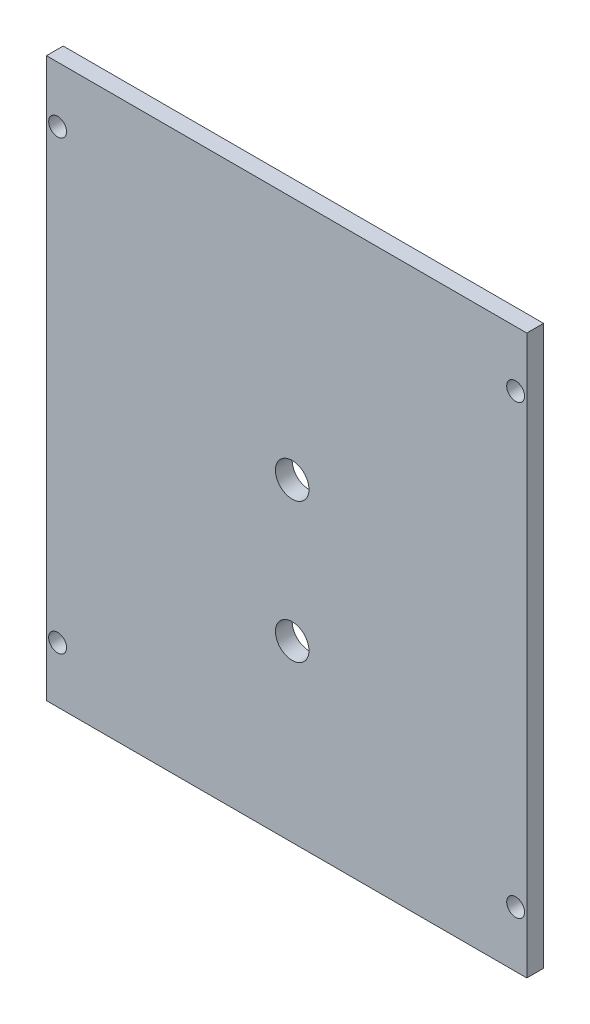
ISO-10303-21;
HEADER;
FILE_DESCRIPTION(('STEP AP214'),'2;1');
FILE_NAME('part.step','',(''),(''),'','','');
FILE_SCHEMA(('AUTOMOTIVE_DESIGN { 1 0 10303 214 1 1 1 1 }'));
ENDSEC;
DATA;
#1=APPLICATION_CONTEXT('core data for automotive mechanical design processes');
#2=APPLICATION_PROTOCOL_DEFINITION('international standard','automotive_design',2000,#1);
#3=PRODUCT_CONTEXT('',#1,'mechanical');
#4=PRODUCT('Part','Part','',(#3));
#5=PRODUCT_RELATED_PRODUCT_CATEGORY('part','',(#4));
#6=PRODUCT_DEFINITION_FORMATION('','',#4);
#7=PRODUCT_DEFINITION_CONTEXT('part definition',#1,'design');
#8=PRODUCT_DEFINITION('design','',#6,#7);
#9=PRODUCT_DEFINITION_SHAPE('','',#8);
#10=(LENGTH_UNIT() NAMED_UNIT(*) SI_UNIT(.MILLI.,.METRE.));
#11=(NAMED_UNIT(*) PLANE_ANGLE_UNIT() SI_UNIT($,.RADIAN.));
#12=(NAMED_UNIT(*) SI_UNIT($,.STERADIAN.) SOLID_ANGLE_UNIT());
#13=UNCERTAINTY_MEASURE_WITH_UNIT(LENGTH_MEASURE(1.E-05),#10,'distance_accuracy_value','');
#14=(GEOMETRIC_REPRESENTATION_CONTEXT(3) GLOBAL_UNCERTAINTY_ASSIGNED_CONTEXT((#13)) GLOBAL_UNIT_ASSIGNED_CONTEXT((#10,
#11,#12)) REPRESENTATION_CONTEXT('',''));
#15=CARTESIAN_POINT('',(0.,0.,0.));
#16=DIRECTION('',(0.,0.,1.));
#17=DIRECTION('',(1.,0.,0.));
#18=AXIS2_PLACEMENT_3D('',#15,#16,#17);
#19=CARTESIAN_POINT('',(0.,0.,3.));
#20=DIRECTION('',(0.,1.,0.));
#21=DIRECTION('',(0.,0.,1.));
#22=AXIS2_PLACEMENT_3D('',#19,#20,#21);
#23=PLANE('',#22);
#24=DIRECTION('',(1.,0.,0.));
#25=VECTOR('',#24,1.);
#26=CARTESIAN_POINT('',(0.,0.,0.));
#27=LINE('',#26,#25);
#28=CARTESIAN_POINT('',(-2.,0.,0.));
#29=VERTEX_POINT('',#28);
#30=CARTESIAN_POINT('',(84.,0.,0.));
#31=VERTEX_POINT('',#30);
#32=EDGE_CURVE('E62',#29,#31,#27,.T.);
#33=ORIENTED_EDGE('',*,*,#32,.T.);
#34=DIRECTION('',(0.,0.,-1.));
#35=VECTOR('',#34,1.);
#36=CARTESIAN_POINT('',(84.,0.,3.));
#37=LINE('',#36,#35);
#38=CARTESIAN_POINT('',(84.,0.,3.));
#39=VERTEX_POINT('',#38);
#40=EDGE_CURVE('E11',#39,#31,#37,.T.);
#41=ORIENTED_EDGE('',*,*,#40,.F.);
#42=DIRECTION('',(1.,0.,0.));
#43=VECTOR('',#42,1.);
#44=CARTESIAN_POINT('',(0.,0.,3.));
#45=LINE('',#44,#43);
#46=CARTESIAN_POINT('',(-2.,0.,3.));
#47=VERTEX_POINT('',#46);
#48=EDGE_CURVE('E89',#47,#39,#45,.T.);
#49=ORIENTED_EDGE('',*,*,#48,.F.);
#50=DIRECTION('',(0.,0.,1.));
#51=VECTOR('',#50,1.);
#52=CARTESIAN_POINT('',(-2.,0.,0.));
#53=LINE('',#52,#51);
#54=EDGE_CURVE('E88',#29,#47,#53,.T.);
#55=ORIENTED_EDGE('',*,*,#54,.F.);
#56=EDGE_LOOP('',(#33,#41,#49,#55));
#57=FACE_BOUND('',#56,.T.);
#58=ADVANCED_FACE('F35',(#57),#23,.F.);
#59=CARTESIAN_POINT('',(84.,0.,3.));
#60=DIRECTION('',(-1.,0.,0.));
#61=DIRECTION('',(0.,0.,1.));
#62=AXIS2_PLACEMENT_3D('',#59,#60,#61);
#63=PLANE('',#62);
#64=DIRECTION('',(0.,1.,0.));
#65=VECTOR('',#64,1.);
#66=CARTESIAN_POINT('',(84.,0.,0.));
#67=LINE('',#66,#65);
#68=CARTESIAN_POINT('',(84.,100.,0.));
#69=VERTEX_POINT('',#68);
#70=EDGE_CURVE('E84',#31,#69,#67,.T.);
#71=ORIENTED_EDGE('',*,*,#70,.T.);
#72=DIRECTION('',(0.,0.,-1.));
#73=VECTOR('',#72,1.);
#74=CARTESIAN_POINT('',(84.,100.,3.));
#75=LINE('',#74,#73);
#76=CARTESIAN_POINT('',(84.,100.,3.));
#77=VERTEX_POINT('',#76);
#78=EDGE_CURVE('E43',#77,#69,#75,.T.);
#79=ORIENTED_EDGE('',*,*,#78,.F.);
#80=DIRECTION('',(0.,1.,0.));
#81=VECTOR('',#80,1.);
#82=CARTESIAN_POINT('',(84.,0.,3.));
#83=LINE('',#82,#81);
#84=EDGE_CURVE('E51',#39,#77,#83,.T.);
#85=ORIENTED_EDGE('',*,*,#84,.F.);
#86=ORIENTED_EDGE('',*,*,#40,.T.);
#87=EDGE_LOOP('',(#71,#79,#85,#86));
#88=FACE_BOUND('',#87,.T.);
#89=ADVANCED_FACE('F125',(#88),#63,.F.);
#90=CARTESIAN_POINT('',(0.,100.,3.));
#91=DIRECTION('',(0.,-1.,0.));
#92=DIRECTION('',(0.,0.,-1.));
#93=AXIS2_PLACEMENT_3D('',#90,#91,#92);
#94=PLANE('',#93);
#95=DIRECTION('',(-1.,0.,0.));
#96=VECTOR('',#95,1.);
#97=CARTESIAN_POINT('',(0.,100.,0.));
#98=LINE('',#97,#96);
#99=CARTESIAN_POINT('',(-2.,100.,0.));
#100=VERTEX_POINT('',#99);
#101=EDGE_CURVE('E70',#69,#100,#98,.T.);
#102=ORIENTED_EDGE('',*,*,#101,.T.);
#103=DIRECTION('',(0.,0.,-1.));
#104=VECTOR('',#103,1.);
#105=CARTESIAN_POINT('',(-2.,100.,0.));
#106=LINE('',#105,#104);
#107=CARTESIAN_POINT('',(-2.,100.,3.));
#108=VERTEX_POINT('',#107);
#109=EDGE_CURVE('E96',#108,#100,#106,.T.);
#110=ORIENTED_EDGE('',*,*,#109,.F.);
#111=DIRECTION('',(-1.,0.,0.));
#112=VECTOR('',#111,1.);
#113=CARTESIAN_POINT('',(0.,100.,3.));
#114=LINE('',#113,#112);
#115=EDGE_CURVE('E119',#77,#108,#114,.T.);
#116=ORIENTED_EDGE('',*,*,#115,.F.);
#117=ORIENTED_EDGE('',*,*,#78,.T.);
#118=EDGE_LOOP('',(#102,#110,#116,#117));
#119=FACE_BOUND('',#118,.T.);
#120=ADVANCED_FACE('F123',(#119),#94,.F.);
#121=CARTESIAN_POINT('',(0.,0.,3.));
#122=DIRECTION('',(0.,0.,-1.));
#123=DIRECTION('',(-1.,0.,0.));
#124=AXIS2_PLACEMENT_3D('',#121,#122,#123);
#125=PLANE('',#124);
#126=CARTESIAN_POINT('',(82.,90.,3.));
#127=DIRECTION('',(0.,0.,1.));
#128=DIRECTION('',(-1.,0.,0.));
#129=AXIS2_PLACEMENT_3D('',#126,#127,#128);
#130=CIRCLE('',#129,1.6);
#131=CARTESIAN_POINT('',(80.4,90.,3.));
#132=VERTEX_POINT('',#131);
#133=EDGE_CURVE('E173',#132,#132,#130,.T.);
#134=ORIENTED_EDGE('',*,*,#133,.F.);
#135=EDGE_LOOP('',(#134));
#136=FACE_BOUND('',#135,.T.);
#137=CARTESIAN_POINT('',(0.,90.,3.));
#138=DIRECTION('',(0.,0.,1.));
#139=DIRECTION('',(1.,0.,0.));
#140=AXIS2_PLACEMENT_3D('',#137,#138,#139);
#141=CIRCLE('',#140,1.6);
#142=CARTESIAN_POINT('',(1.6,90.,3.));
#143=VERTEX_POINT('',#142);
#144=EDGE_CURVE('E178',#143,#143,#141,.T.);
#145=ORIENTED_EDGE('',*,*,#144,.F.);
#146=EDGE_LOOP('',(#145));
#147=FACE_BOUND('',#146,.T.);
#148=CARTESIAN_POINT('',(0.,10.,3.));
#149=DIRECTION('',(0.,0.,1.));
#150=DIRECTION('',(-1.,0.,0.));
#151=AXIS2_PLACEMENT_3D('',#148,#149,#150);
#152=CIRCLE('',#151,1.6);
#153=CARTESIAN_POINT('',(-1.6,10.,3.));
#154=VERTEX_POINT('',#153);
#155=EDGE_CURVE('E186',#154,#154,#152,.T.);
#156=ORIENTED_EDGE('',*,*,#155,.F.);
#157=EDGE_LOOP('',(#156));
#158=FACE_BOUND('',#157,.T.);
#159=CARTESIAN_POINT('',(82.,10.,3.));
#160=DIRECTION('',(0.,0.,1.));
#161=DIRECTION('',(1.,0.,0.));
#162=AXIS2_PLACEMENT_3D('',#159,#160,#161);
#163=CIRCLE('',#162,1.6);
#164=CARTESIAN_POINT('',(83.6,10.,3.));
#165=VERTEX_POINT('',#164);
#166=EDGE_CURVE('E100',#165,#165,#163,.T.);
#167=ORIENTED_EDGE('',*,*,#166,.F.);
#168=EDGE_LOOP('',(#167));
#169=FACE_BOUND('',#168,.T.);
#170=CARTESIAN_POINT('',(42.,56.24,3.));
#171=DIRECTION('',(0.,0.,1.));
#172=DIRECTION('',(1.,0.,0.));
#173=AXIS2_PLACEMENT_3D('',#170,#171,#172);
#174=CIRCLE('',#173,3.);
#175=CARTESIAN_POINT('',(45.,56.24,3.));
#176=VERTEX_POINT('',#175);
#177=EDGE_CURVE('E106',#176,#176,#174,.T.);
#178=ORIENTED_EDGE('',*,*,#177,.F.);
#179=EDGE_LOOP('',(#178));
#180=FACE_BOUND('',#179,.T.);
#181=CARTESIAN_POINT('',(42.,31.24,3.));
#182=DIRECTION('',(0.,0.,1.));
#183=DIRECTION('',(1.,0.,0.));
#184=AXIS2_PLACEMENT_3D('',#181,#182,#183);
#185=CIRCLE('',#184,3.);
#186=CARTESIAN_POINT('',(45.,31.24,3.));
#187=VERTEX_POINT('',#186);
#188=EDGE_CURVE('E110',#187,#187,#185,.T.);
#189=ORIENTED_EDGE('',*,*,#188,.F.);
#190=EDGE_LOOP('',(#189));
#191=FACE_BOUND('',#190,.T.);
#192=ORIENTED_EDGE('',*,*,#115,.T.);
#193=DIRECTION('',(0.,1.,0.));
#194=VECTOR('',#193,1.);
#195=CARTESIAN_POINT('',(-2.,0.,3.));
#196=LINE('',#195,#194);
#197=EDGE_CURVE('E93',#47,#108,#196,.T.);
#198=ORIENTED_EDGE('',*,*,#197,.F.);
#199=ORIENTED_EDGE('',*,*,#48,.T.);
#200=ORIENTED_EDGE('',*,*,#84,.T.);
#201=EDGE_LOOP('',(#192,#198,#199,#200));
#202=FACE_BOUND('',#201,.T.);
#203=ADVANCED_FACE('F131',(#136,#147,#158,#169,#180,#191,#202),#125,.F.);
#204=CARTESIAN_POINT('',(0.,0.,0.));
#205=DIRECTION('',(0.,0.,-1.));
#206=DIRECTION('',(-1.,0.,0.));
#207=AXIS2_PLACEMENT_3D('',#204,#205,#206);
#208=PLANE('',#207);
#209=CARTESIAN_POINT('',(82.,90.,0.));
#210=DIRECTION('',(0.,0.,1.));
#211=DIRECTION('',(-1.,0.,0.));
#212=AXIS2_PLACEMENT_3D('',#209,#210,#211);
#213=CIRCLE('',#212,1.6);
#214=CARTESIAN_POINT('',(80.4,90.,0.));
#215=VERTEX_POINT('',#214);
#216=EDGE_CURVE('E170',#215,#215,#213,.T.);
#217=ORIENTED_EDGE('',*,*,#216,.T.);
#218=EDGE_LOOP('',(#217));
#219=FACE_BOUND('',#218,.T.);
#220=CARTESIAN_POINT('',(0.,90.,0.));
#221=DIRECTION('',(0.,0.,1.));
#222=DIRECTION('',(1.,0.,0.));
#223=AXIS2_PLACEMENT_3D('',#220,#221,#222);
#224=CIRCLE('',#223,1.6);
#225=CARTESIAN_POINT('',(1.6,90.,0.));
#226=VERTEX_POINT('',#225);
#227=EDGE_CURVE('E174',#226,#226,#224,.T.);
#228=ORIENTED_EDGE('',*,*,#227,.T.);
#229=EDGE_LOOP('',(#228));
#230=FACE_BOUND('',#229,.T.);
#231=CARTESIAN_POINT('',(0.,10.,0.));
#232=DIRECTION('',(0.,0.,1.));
#233=DIRECTION('',(-1.,0.,0.));
#234=AXIS2_PLACEMENT_3D('',#231,#232,#233);
#235=CIRCLE('',#234,1.6);
#236=CARTESIAN_POINT('',(-1.6,10.,0.));
#237=VERTEX_POINT('',#236);
#238=EDGE_CURVE('E183',#237,#237,#235,.T.);
#239=ORIENTED_EDGE('',*,*,#238,.T.);
#240=EDGE_LOOP('',(#239));
#241=FACE_BOUND('',#240,.T.);
#242=CARTESIAN_POINT('',(82.,10.,0.));
#243=DIRECTION('',(0.,0.,1.));
#244=DIRECTION('',(1.,0.,0.));
#245=AXIS2_PLACEMENT_3D('',#242,#243,#244);
#246=CIRCLE('',#245,1.6);
#247=CARTESIAN_POINT('',(83.6,10.,0.));
#248=VERTEX_POINT('',#247);
#249=EDGE_CURVE('E97',#248,#248,#246,.T.);
#250=ORIENTED_EDGE('',*,*,#249,.T.);
#251=EDGE_LOOP('',(#250));
#252=FACE_BOUND('',#251,.T.);
#253=CARTESIAN_POINT('',(42.,56.24,0.));
#254=DIRECTION('',(0.,0.,1.));
#255=DIRECTION('',(1.,0.,0.));
#256=AXIS2_PLACEMENT_3D('',#253,#254,#255);
#257=CIRCLE('',#256,3.);
#258=CARTESIAN_POINT('',(45.,56.24,0.));
#259=VERTEX_POINT('',#258);
#260=EDGE_CURVE('E107',#259,#259,#257,.T.);
#261=ORIENTED_EDGE('',*,*,#260,.T.);
#262=EDGE_LOOP('',(#261));
#263=FACE_BOUND('',#262,.T.);
#264=CARTESIAN_POINT('',(42.,31.24,0.));
#265=DIRECTION('',(0.,0.,1.));
#266=DIRECTION('',(1.,0.,0.));
#267=AXIS2_PLACEMENT_3D('',#264,#265,#266);
#268=CIRCLE('',#267,3.);
#269=CARTESIAN_POINT('',(45.,31.24,0.));
#270=VERTEX_POINT('',#269);
#271=EDGE_CURVE('E85',#270,#270,#268,.T.);
#272=ORIENTED_EDGE('',*,*,#271,.T.);
#273=EDGE_LOOP('',(#272));
#274=FACE_BOUND('',#273,.T.);
#275=ORIENTED_EDGE('',*,*,#32,.F.);
#276=DIRECTION('',(0.,-1.,0.));
#277=VECTOR('',#276,1.);
#278=CARTESIAN_POINT('',(-2.,0.,0.));
#279=LINE('',#278,#277);
#280=EDGE_CURVE('E83',#100,#29,#279,.T.);
#281=ORIENTED_EDGE('',*,*,#280,.F.);
#282=ORIENTED_EDGE('',*,*,#101,.F.);
#283=ORIENTED_EDGE('',*,*,#70,.F.);
#284=EDGE_LOOP('',(#275,#281,#282,#283));
#285=FACE_BOUND('',#284,.T.);
#286=ADVANCED_FACE('F81',(#219,#230,#241,#252,#263,#274,#285),#208,.T.);
#287=CARTESIAN_POINT('',(42.,31.24,0.));
#288=DIRECTION('',(0.,0.,1.));
#289=DIRECTION('',(1.,0.,0.));
#290=AXIS2_PLACEMENT_3D('',#287,#288,#289);
#291=CYLINDRICAL_SURFACE('',#290,3.);
#292=ORIENTED_EDGE('',*,*,#271,.F.);
#293=EDGE_LOOP('',(#292));
#294=FACE_BOUND('',#293,.T.);
#295=ORIENTED_EDGE('',*,*,#188,.T.);
#296=EDGE_LOOP('',(#295));
#297=FACE_BOUND('',#296,.T.);
#298=ADVANCED_FACE('F137',(#294,#297),#291,.F.);
#299=CARTESIAN_POINT('',(42.,56.24,0.));
#300=DIRECTION('',(0.,0.,1.));
#301=DIRECTION('',(1.,0.,0.));
#302=AXIS2_PLACEMENT_3D('',#299,#300,#301);
#303=CYLINDRICAL_SURFACE('',#302,3.);
#304=ORIENTED_EDGE('',*,*,#260,.F.);
#305=EDGE_LOOP('',(#304));
#306=FACE_BOUND('',#305,.T.);
#307=ORIENTED_EDGE('',*,*,#177,.T.);
#308=EDGE_LOOP('',(#307));
#309=FACE_BOUND('',#308,.T.);
#310=ADVANCED_FACE('F143',(#306,#309),#303,.F.);
#311=CARTESIAN_POINT('',(-2.,0.,0.));
#312=DIRECTION('',(1.,0.,0.));
#313=DIRECTION('',(0.,0.,-1.));
#314=AXIS2_PLACEMENT_3D('',#311,#312,#313);
#315=PLANE('',#314);
#316=ORIENTED_EDGE('',*,*,#280,.T.);
#317=ORIENTED_EDGE('',*,*,#54,.T.);
#318=ORIENTED_EDGE('',*,*,#197,.T.);
#319=ORIENTED_EDGE('',*,*,#109,.T.);
#320=EDGE_LOOP('',(#316,#317,#318,#319));
#321=FACE_BOUND('',#320,.T.);
#322=ADVANCED_FACE('F95',(#321),#315,.F.);
#323=CARTESIAN_POINT('',(82.,10.,0.));
#324=DIRECTION('',(0.,0.,1.));
#325=DIRECTION('',(1.,0.,0.));
#326=AXIS2_PLACEMENT_3D('',#323,#324,#325);
#327=CYLINDRICAL_SURFACE('',#326,1.6);
#328=ORIENTED_EDGE('',*,*,#249,.F.);
#329=EDGE_LOOP('',(#328));
#330=FACE_BOUND('',#329,.T.);
#331=ORIENTED_EDGE('',*,*,#166,.T.);
#332=EDGE_LOOP('',(#331));
#333=FACE_BOUND('',#332,.T.);
#334=ADVANCED_FACE('F150',(#330,#333),#327,.F.);
#335=CARTESIAN_POINT('',(0.,10.,0.));
#336=DIRECTION('',(0.,0.,1.));
#337=DIRECTION('',(1.,0.,0.));
#338=AXIS2_PLACEMENT_3D('',#335,#336,#337);
#339=CYLINDRICAL_SURFACE('',#338,1.6);
#340=ORIENTED_EDGE('',*,*,#238,.F.);
#341=EDGE_LOOP('',(#340));
#342=FACE_BOUND('',#341,.T.);
#343=ORIENTED_EDGE('',*,*,#155,.T.);
#344=EDGE_LOOP('',(#343));
#345=FACE_BOUND('',#344,.T.);
#346=ADVANCED_FACE('F153',(#342,#345),#339,.F.);
#347=CARTESIAN_POINT('',(0.,90.,0.));
#348=DIRECTION('',(0.,0.,1.));
#349=DIRECTION('',(1.,0.,0.));
#350=AXIS2_PLACEMENT_3D('',#347,#348,#349);
#351=CYLINDRICAL_SURFACE('',#350,1.6);
#352=ORIENTED_EDGE('',*,*,#227,.F.);
#353=EDGE_LOOP('',(#352));
#354=FACE_BOUND('',#353,.T.);
#355=ORIENTED_EDGE('',*,*,#144,.T.);
#356=EDGE_LOOP('',(#355));
#357=FACE_BOUND('',#356,.T.);
#358=ADVANCED_FACE('F157',(#354,#357),#351,.F.);
#359=CARTESIAN_POINT('',(82.,90.,0.));
#360=DIRECTION('',(0.,0.,1.));
#361=DIRECTION('',(1.,0.,0.));
#362=AXIS2_PLACEMENT_3D('',#359,#360,#361);
#363=CYLINDRICAL_SURFACE('',#362,1.6);
#364=ORIENTED_EDGE('',*,*,#216,.F.);
#365=EDGE_LOOP('',(#364));
#366=FACE_BOUND('',#365,.T.);
#367=ORIENTED_EDGE('',*,*,#133,.T.);
#368=EDGE_LOOP('',(#367));
#369=FACE_BOUND('',#368,.T.);
#370=ADVANCED_FACE('F161',(#366,#369),#363,.F.);
#371=CLOSED_SHELL('',(#58,#89,#120,#203,#286,#298,#310,#322,#334,#346,#358,#370));
#372=MANIFOLD_SOLID_BREP('B2',#371);
#373=ADVANCED_BREP_SHAPE_REPRESENTATION('',(#18,#372),#14);
#374=SHAPE_DEFINITION_REPRESENTATION(#9,#373);
ENDSEC;
END-ISO-10303-21;
